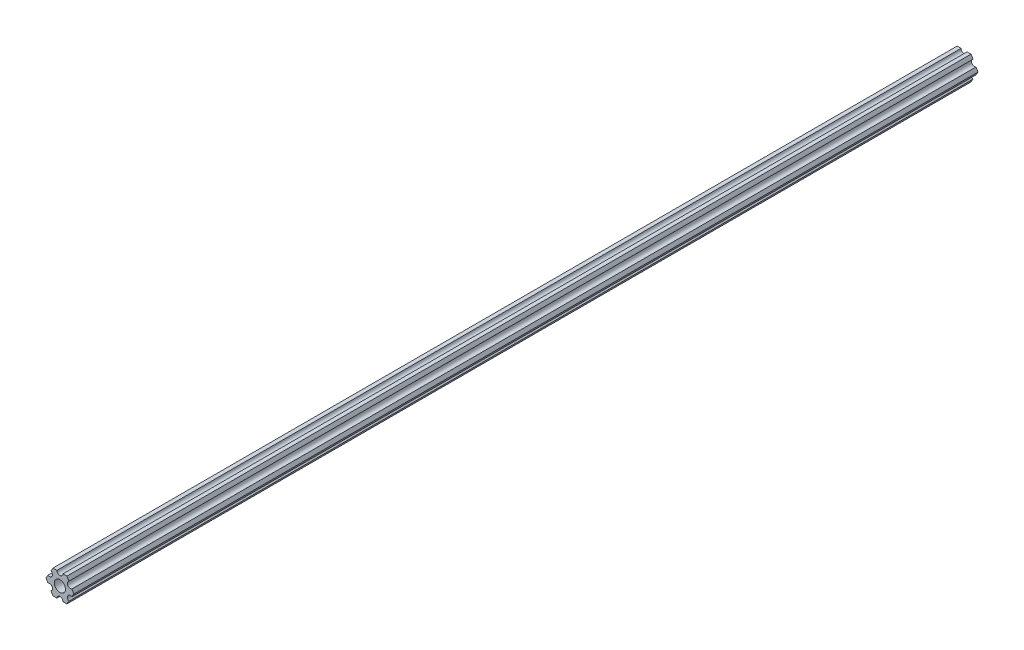
ISO-10303-21;
HEADER;
FILE_DESCRIPTION(('STEP AP214'),'2;1');
FILE_NAME('part.step','',(''),(''),'','','');
FILE_SCHEMA(('AUTOMOTIVE_DESIGN { 1 0 10303 214 1 1 1 1 }'));
ENDSEC;
DATA;
#1=APPLICATION_CONTEXT('core data for automotive mechanical design processes');
#2=APPLICATION_PROTOCOL_DEFINITION('international standard','automotive_design',2000,#1);
#3=PRODUCT_CONTEXT('',#1,'mechanical');
#4=PRODUCT('Part','Part','',(#3));
#5=PRODUCT_RELATED_PRODUCT_CATEGORY('part','',(#4));
#6=PRODUCT_DEFINITION_FORMATION('','',#4);
#7=PRODUCT_DEFINITION_CONTEXT('part definition',#1,'design');
#8=PRODUCT_DEFINITION('design','',#6,#7);
#9=PRODUCT_DEFINITION_SHAPE('','',#8);
#10=(LENGTH_UNIT() NAMED_UNIT(*) SI_UNIT(.MILLI.,.METRE.));
#11=(NAMED_UNIT(*) PLANE_ANGLE_UNIT() SI_UNIT($,.RADIAN.));
#12=(NAMED_UNIT(*) SI_UNIT($,.STERADIAN.) SOLID_ANGLE_UNIT());
#13=UNCERTAINTY_MEASURE_WITH_UNIT(LENGTH_MEASURE(1.E-05),#10,'distance_accuracy_value','');
#14=(GEOMETRIC_REPRESENTATION_CONTEXT(3) GLOBAL_UNCERTAINTY_ASSIGNED_CONTEXT((#13)) GLOBAL_UNIT_ASSIGNED_CONTEXT((#10,
#11,#12)) REPRESENTATION_CONTEXT('',''));
#15=CARTESIAN_POINT('',(0.,0.,0.));
#16=DIRECTION('',(0.,0.,1.));
#17=DIRECTION('',(1.,0.,0.));
#18=AXIS2_PLACEMENT_3D('',#15,#16,#17);
#19=CARTESIAN_POINT('',(5.49926150638083,-3.17499966684068,476.25));
#20=DIRECTION('',(0.,0.,-1.));
#21=DIRECTION('',(-1.,0.,0.));
#22=AXIS2_PLACEMENT_3D('',#19,#20,#21);
#23=CYLINDRICAL_SURFACE('',#22,1.58750000000001);
#24=CARTESIAN_POINT('',(5.49926150638083,-3.17499966684068,0.));
#25=DIRECTION('',(0.,0.,1.));
#26=DIRECTION('',(1.,0.,0.));
#27=AXIS2_PLACEMENT_3D('',#24,#25,#26);
#28=CIRCLE('',#27,1.58750000000001);
#29=CARTESIAN_POINT('',(6.29301142309098,-1.80018429024546,0.));
#30=VERTEX_POINT('',#29);
#31=CARTESIAN_POINT('',(4.70551158967068,-4.54981504343589,0.));
#32=VERTEX_POINT('',#31);
#33=EDGE_CURVE('E190',#30,#32,#28,.T.);
#34=ORIENTED_EDGE('',*,*,#33,.F.);
#35=DIRECTION('',(0.,0.,-1.));
#36=VECTOR('',#35,1.);
#37=CARTESIAN_POINT('',(6.29301142309098,-1.80018429024546,476.25));
#38=LINE('',#37,#36);
#39=CARTESIAN_POINT('',(6.29301142309098,-1.80018429024546,476.25));
#40=VERTEX_POINT('',#39);
#41=EDGE_CURVE('E11',#40,#30,#38,.T.);
#42=ORIENTED_EDGE('',*,*,#41,.F.);
#43=CARTESIAN_POINT('',(5.49926150638083,-3.17499966684068,476.25));
#44=DIRECTION('',(0.,0.,1.));
#45=DIRECTION('',(1.,0.,0.));
#46=AXIS2_PLACEMENT_3D('',#43,#44,#45);
#47=CIRCLE('',#46,1.58750000000001);
#48=CARTESIAN_POINT('',(4.70551158967068,-4.54981504343589,476.25));
#49=VERTEX_POINT('',#48);
#50=EDGE_CURVE('E241',#40,#49,#47,.T.);
#51=ORIENTED_EDGE('',*,*,#50,.T.);
#52=DIRECTION('',(0.,0.,-1.));
#53=VECTOR('',#52,1.);
#54=CARTESIAN_POINT('',(4.70551158967068,-4.54981504343589,476.25));
#55=LINE('',#54,#53);
#56=EDGE_CURVE('E36',#49,#32,#55,.T.);
#57=ORIENTED_EDGE('',*,*,#56,.T.);
#58=EDGE_LOOP('',(#34,#42,#51,#57));
#59=FACE_BOUND('',#58,.T.);
#60=ADVANCED_FACE('F33',(#59),#23,.F.);
#61=CARTESIAN_POINT('',(7.33234841870826,4.44212518856872E-07,476.25));
#62=DIRECTION('',(0.866025434075723,-0.499999947533953,0.));
#63=DIRECTION('',(0.499999947533953,0.866025434075723,0.));
#64=AXIS2_PLACEMENT_3D('',#61,#62,#63);
#65=PLANE('',#64);
#66=DIRECTION('',(-0.499999947533953,-0.866025434075723,0.));
#67=VECTOR('',#66,1.);
#68=CARTESIAN_POINT('',(7.33234841870826,4.44212518856872E-07,0.));
#69=LINE('',#68,#67);
#70=CARTESIAN_POINT('',(7.33234841870826,4.44212518856872E-07,0.));
#71=VERTEX_POINT('',#70);
#72=EDGE_CURVE('E239',#71,#30,#69,.T.);
#73=ORIENTED_EDGE('',*,*,#72,.F.);
#74=DIRECTION('',(0.,0.,-1.));
#75=VECTOR('',#74,1.);
#76=CARTESIAN_POINT('',(7.33234841870826,4.44212518856872E-07,476.25));
#77=LINE('',#76,#75);
#78=CARTESIAN_POINT('',(7.33234841870826,4.44212518856872E-07,476.25));
#79=VERTEX_POINT('',#78);
#80=EDGE_CURVE('E42',#79,#71,#77,.T.);
#81=ORIENTED_EDGE('',*,*,#80,.F.);
#82=DIRECTION('',(-0.499999947533953,-0.866025434075723,0.));
#83=VECTOR('',#82,1.);
#84=CARTESIAN_POINT('',(7.33234841870826,4.44212518856872E-07,476.25));
#85=LINE('',#84,#83);
#86=EDGE_CURVE('E180',#79,#40,#85,.T.);
#87=ORIENTED_EDGE('',*,*,#86,.T.);
#88=ORIENTED_EDGE('',*,*,#41,.T.);
#89=EDGE_LOOP('',(#73,#81,#87,#88));
#90=FACE_BOUND('',#89,.T.);
#91=ADVANCED_FACE('F273',(#90),#65,.T.);
#92=CARTESIAN_POINT('',(6.29301120497139,1.80018505273895,476.25));
#93=DIRECTION('',(0.866025373493145,0.500000052466056,0.));
#94=DIRECTION('',(-0.500000052466056,0.866025373493145,0.));
#95=AXIS2_PLACEMENT_3D('',#92,#93,#94);
#96=PLANE('',#95);
#97=DIRECTION('',(0.500000052466056,-0.866025373493145,0.));
#98=VECTOR('',#97,1.);
#99=CARTESIAN_POINT('',(6.29301120497139,1.80018505273895,0.));
#100=LINE('',#99,#98);
#101=CARTESIAN_POINT('',(6.29301120497139,1.80018505273895,0.));
#102=VERTEX_POINT('',#101);
#103=EDGE_CURVE('E167',#102,#71,#100,.T.);
#104=ORIENTED_EDGE('',*,*,#103,.F.);
#105=DIRECTION('',(0.,0.,-1.));
#106=VECTOR('',#105,1.);
#107=CARTESIAN_POINT('',(6.29301120497139,1.80018505273895,476.25));
#108=LINE('',#107,#106);
#109=CARTESIAN_POINT('',(6.29301120497139,1.80018505273895,476.25));
#110=VERTEX_POINT('',#109);
#111=EDGE_CURVE('E162',#110,#102,#108,.T.);
#112=ORIENTED_EDGE('',*,*,#111,.F.);
#113=DIRECTION('',(0.500000052466056,-0.866025373493145,0.));
#114=VECTOR('',#113,1.);
#115=CARTESIAN_POINT('',(6.29301120497139,1.80018505273895,476.25));
#116=LINE('',#115,#114);
#117=EDGE_CURVE('E165',#110,#79,#116,.T.);
#118=ORIENTED_EDGE('',*,*,#117,.T.);
#119=ORIENTED_EDGE('',*,*,#80,.T.);
#120=EDGE_LOOP('',(#104,#112,#118,#119));
#121=FACE_BOUND('',#120,.T.);
#122=ADVANCED_FACE('F164',(#121),#96,.T.);
#123=CARTESIAN_POINT('',(5.49926112168152,3.17500033315931,476.25));
#124=DIRECTION('',(0.,0.,-1.));
#125=DIRECTION('',(-1.,0.,0.));
#126=AXIS2_PLACEMENT_3D('',#123,#124,#125);
#127=CYLINDRICAL_SURFACE('',#126,1.5875);
#128=CARTESIAN_POINT('',(5.49926112168152,3.17500033315931,0.));
#129=DIRECTION('',(0.,0.,1.));
#130=DIRECTION('',(1.,0.,0.));
#131=AXIS2_PLACEMENT_3D('',#128,#129,#130);
#132=CIRCLE('',#131,1.5875);
#133=CARTESIAN_POINT('',(4.70551103839166,4.54981561357968,0.));
#134=VERTEX_POINT('',#133);
#135=EDGE_CURVE('E236',#134,#102,#132,.T.);
#136=ORIENTED_EDGE('',*,*,#135,.F.);
#137=DIRECTION('',(0.,0.,-1.));
#138=VECTOR('',#137,1.);
#139=CARTESIAN_POINT('',(4.70551103839166,4.54981561357968,476.25));
#140=LINE('',#139,#138);
#141=CARTESIAN_POINT('',(4.70551103839166,4.54981561357968,476.25));
#142=VERTEX_POINT('',#141);
#143=EDGE_CURVE('E172',#142,#134,#140,.T.);
#144=ORIENTED_EDGE('',*,*,#143,.F.);
#145=CARTESIAN_POINT('',(5.49926112168152,3.17500033315931,476.25));
#146=DIRECTION('',(0.,0.,1.));
#147=DIRECTION('',(1.,0.,0.));
#148=AXIS2_PLACEMENT_3D('',#145,#146,#147);
#149=CIRCLE('',#148,1.5875);
#150=EDGE_CURVE('E178',#142,#110,#149,.T.);
#151=ORIENTED_EDGE('',*,*,#150,.T.);
#152=ORIENTED_EDGE('',*,*,#111,.T.);
#153=EDGE_LOOP('',(#136,#144,#151,#152));
#154=FACE_BOUND('',#153,.T.);
#155=ADVANCED_FACE('F182',(#154),#127,.F.);
#156=CARTESIAN_POINT('',(3.66617382465472,6.35000022210622,476.25));
#157=DIRECTION('',(0.866025373493145,0.500000052466056,0.));
#158=DIRECTION('',(-0.500000052466056,0.866025373493145,0.));
#159=AXIS2_PLACEMENT_3D('',#156,#157,#158);
#160=PLANE('',#159);
#161=DIRECTION('',(0.500000052466056,-0.866025373493145,0.));
#162=VECTOR('',#161,1.);
#163=CARTESIAN_POINT('',(3.66617382465472,6.35000022210622,0.));
#164=LINE('',#163,#162);
#165=CARTESIAN_POINT('',(3.66617382465472,6.35000022210622,0.));
#166=VERTEX_POINT('',#165);
#167=EDGE_CURVE('E233',#166,#134,#164,.T.);
#168=ORIENTED_EDGE('',*,*,#167,.F.);
#169=DIRECTION('',(0.,0.,-1.));
#170=VECTOR('',#169,1.);
#171=CARTESIAN_POINT('',(3.66617382465472,6.35000022210622,476.25));
#172=LINE('',#171,#170);
#173=CARTESIAN_POINT('',(3.66617382465472,6.35000022210622,476.25));
#174=VERTEX_POINT('',#173);
#175=EDGE_CURVE('E245',#174,#166,#172,.T.);
#176=ORIENTED_EDGE('',*,*,#175,.F.);
#177=DIRECTION('',(0.500000052466056,-0.866025373493145,0.));
#178=VECTOR('',#177,1.);
#179=CARTESIAN_POINT('',(3.66617382465472,6.35000022210622,476.25));
#180=LINE('',#179,#178);
#181=EDGE_CURVE('E183',#174,#142,#180,.T.);
#182=ORIENTED_EDGE('',*,*,#181,.T.);
#183=ORIENTED_EDGE('',*,*,#143,.T.);
#184=EDGE_LOOP('',(#168,#176,#182,#183));
#185=FACE_BOUND('',#184,.T.);
#186=ADVANCED_FACE('F286',(#185),#160,.T.);
#187=CARTESIAN_POINT('',(1.58749961530066,6.35000022210623,476.25));
#188=DIRECTION('',(0.,1.,0.));
#189=DIRECTION('',(-1.,0.,0.));
#190=AXIS2_PLACEMENT_3D('',#187,#188,#189);
#191=PLANE('',#190);
#192=DIRECTION('',(1.,0.,0.));
#193=VECTOR('',#192,1.);
#194=CARTESIAN_POINT('',(1.58749961530066,6.35000022210623,0.));
#195=LINE('',#194,#193);
#196=CARTESIAN_POINT('',(1.58749961530066,6.35000022210623,0.));
#197=VERTEX_POINT('',#196);
#198=EDGE_CURVE('E230',#197,#166,#195,.T.);
#199=ORIENTED_EDGE('',*,*,#198,.F.);
#200=DIRECTION('',(0.,0.,-1.));
#201=VECTOR('',#200,1.);
#202=CARTESIAN_POINT('',(1.58749961530066,6.35000022210623,476.25));
#203=LINE('',#202,#201);
#204=CARTESIAN_POINT('',(1.58749961530066,6.35000022210623,476.25));
#205=VERTEX_POINT('',#204);
#206=EDGE_CURVE('E247',#205,#197,#203,.T.);
#207=ORIENTED_EDGE('',*,*,#206,.F.);
#208=DIRECTION('',(1.,0.,0.));
#209=VECTOR('',#208,1.);
#210=CARTESIAN_POINT('',(1.58749961530066,6.35000022210623,476.25));
#211=LINE('',#210,#209);
#212=EDGE_CURVE('E185',#205,#174,#211,.T.);
#213=ORIENTED_EDGE('',*,*,#212,.T.);
#214=ORIENTED_EDGE('',*,*,#175,.T.);
#215=EDGE_LOOP('',(#199,#207,#213,#214));
#216=FACE_BOUND('',#215,.T.);
#217=ADVANCED_FACE('F289',(#216),#191,.T.);
#218=CARTESIAN_POINT('',(-3.84699344941095E-07,6.35000022210623,476.25));
#219=DIRECTION('',(0.,0.,-1.));
#220=DIRECTION('',(-1.,0.,0.));
#221=AXIS2_PLACEMENT_3D('',#218,#219,#220);
#222=CYLINDRICAL_SURFACE('',#221,1.5875);
#223=CARTESIAN_POINT('',(-3.84699344941095E-07,6.35000022210623,0.));
#224=DIRECTION('',(0.,0.,1.));
#225=DIRECTION('',(1.,0.,0.));
#226=AXIS2_PLACEMENT_3D('',#223,#224,#225);
#227=CIRCLE('',#226,1.5875);
#228=CARTESIAN_POINT('',(-1.58750038469935,6.35000022210623,0.));
#229=VERTEX_POINT('',#228);
#230=EDGE_CURVE('E227',#229,#197,#227,.T.);
#231=ORIENTED_EDGE('',*,*,#230,.F.);
#232=DIRECTION('',(0.,0.,-1.));
#233=VECTOR('',#232,1.);
#234=CARTESIAN_POINT('',(-1.58750038469935,6.35000022210623,476.25));
#235=LINE('',#234,#233);
#236=CARTESIAN_POINT('',(-1.58750038469935,6.35000022210623,476.25));
#237=VERTEX_POINT('',#236);
#238=EDGE_CURVE('E249',#237,#229,#235,.T.);
#239=ORIENTED_EDGE('',*,*,#238,.F.);
#240=CARTESIAN_POINT('',(-3.84699344941095E-07,6.35000022210623,476.25));
#241=DIRECTION('',(0.,0.,1.));
#242=DIRECTION('',(1.,0.,0.));
#243=AXIS2_PLACEMENT_3D('',#240,#241,#242);
#244=CIRCLE('',#243,1.5875);
#245=EDGE_CURVE('E394',#237,#205,#244,.T.);
#246=ORIENTED_EDGE('',*,*,#245,.T.);
#247=ORIENTED_EDGE('',*,*,#206,.T.);
#248=EDGE_LOOP('',(#231,#239,#246,#247));
#249=FACE_BOUND('',#248,.T.);
#250=ADVANCED_FACE('F293',(#249),#222,.F.);
#251=CARTESIAN_POINT('',(-3.66617452134701,6.35000022210623,476.25));
#252=DIRECTION('',(0.,1.,0.));
#253=DIRECTION('',(0.,0.,1.));
#254=AXIS2_PLACEMENT_3D('',#251,#252,#253);
#255=PLANE('',#254);
#256=DIRECTION('',(1.,0.,0.));
#257=VECTOR('',#256,1.);
#258=CARTESIAN_POINT('',(-3.66617452134701,6.35000022210623,0.));
#259=LINE('',#258,#257);
#260=CARTESIAN_POINT('',(-3.66617452134701,6.35000022210623,0.));
#261=VERTEX_POINT('',#260);
#262=EDGE_CURVE('E224',#261,#229,#259,.T.);
#263=ORIENTED_EDGE('',*,*,#262,.F.);
#264=DIRECTION('',(0.,0.,-1.));
#265=VECTOR('',#264,1.);
#266=CARTESIAN_POINT('',(-3.66617452134701,6.35000022210623,476.25));
#267=LINE('',#266,#265);
#268=CARTESIAN_POINT('',(-3.66617452134701,6.35000022210623,476.25));
#269=VERTEX_POINT('',#268);
#270=EDGE_CURVE('E251',#269,#261,#267,.T.);
#271=ORIENTED_EDGE('',*,*,#270,.F.);
#272=DIRECTION('',(1.,0.,0.));
#273=VECTOR('',#272,1.);
#274=CARTESIAN_POINT('',(-3.66617452134701,6.35000022210623,476.25));
#275=LINE('',#274,#273);
#276=EDGE_CURVE('E391',#269,#237,#275,.T.);
#277=ORIENTED_EDGE('',*,*,#276,.T.);
#278=ORIENTED_EDGE('',*,*,#238,.T.);
#279=EDGE_LOOP('',(#263,#271,#277,#278));
#280=FACE_BOUND('',#279,.T.);
#281=ADVANCED_FACE('F297',(#280),#255,.T.);
#282=CARTESIAN_POINT('',(-4.70551145677116,4.54981548085265,476.25));
#283=DIRECTION('',(-0.866025447431971,0.499999924400249,0.));
#284=DIRECTION('',(-0.499999924400249,-0.866025447431971,0.));
#285=AXIS2_PLACEMENT_3D('',#282,#283,#284);
#286=PLANE('',#285);
#287=DIRECTION('',(0.499999924400249,0.866025447431971,0.));
#288=VECTOR('',#287,1.);
#289=CARTESIAN_POINT('',(-4.70551145677116,4.54981548085265,0.));
#290=LINE('',#289,#288);
#291=CARTESIAN_POINT('',(-4.70551145677116,4.54981548085265,0.));
#292=VERTEX_POINT('',#291);
#293=EDGE_CURVE('E221',#292,#261,#290,.T.);
#294=ORIENTED_EDGE('',*,*,#293,.F.);
#295=DIRECTION('',(0.,0.,-1.));
#296=VECTOR('',#295,1.);
#297=CARTESIAN_POINT('',(-4.70551145677116,4.54981548085265,476.25));
#298=LINE('',#297,#296);
#299=CARTESIAN_POINT('',(-4.70551145677116,4.54981548085265,476.25));
#300=VERTEX_POINT('',#299);
#301=EDGE_CURVE('E253',#300,#292,#298,.T.);
#302=ORIENTED_EDGE('',*,*,#301,.F.);
#303=DIRECTION('',(0.499999924400249,0.866025447431971,0.));
#304=VECTOR('',#303,1.);
#305=CARTESIAN_POINT('',(-4.70551145677116,4.54981548085265,476.25));
#306=LINE('',#305,#304);
#307=EDGE_CURVE('E388',#300,#269,#306,.T.);
#308=ORIENTED_EDGE('',*,*,#307,.T.);
#309=ORIENTED_EDGE('',*,*,#270,.T.);
#310=EDGE_LOOP('',(#294,#302,#308,#309));
#311=FACE_BOUND('',#310,.T.);
#312=ADVANCED_FACE('F301',(#311),#286,.T.);
#313=CARTESIAN_POINT('',(-5.49926133675655,3.17500008305439,476.25));
#314=DIRECTION('',(0.,0.,-1.));
#315=DIRECTION('',(-1.,0.,0.));
#316=AXIS2_PLACEMENT_3D('',#313,#314,#315);
#317=CYLINDRICAL_SURFACE('',#316,1.5875);
#318=CARTESIAN_POINT('',(-5.49926133675655,3.17500008305439,0.));
#319=DIRECTION('',(0.,0.,1.));
#320=DIRECTION('',(1.,0.,0.));
#321=AXIS2_PLACEMENT_3D('',#318,#319,#320);
#322=CIRCLE('',#321,1.5875);
#323=CARTESIAN_POINT('',(-6.29301121674195,1.80018468525613,0.));
#324=VERTEX_POINT('',#323);
#325=EDGE_CURVE('E218',#324,#292,#322,.T.);
#326=ORIENTED_EDGE('',*,*,#325,.F.);
#327=DIRECTION('',(0.,0.,-1.));
#328=VECTOR('',#327,1.);
#329=CARTESIAN_POINT('',(-6.29301121674195,1.80018468525613,476.25));
#330=LINE('',#329,#328);
#331=CARTESIAN_POINT('',(-6.29301121674195,1.80018468525613,476.25));
#332=VERTEX_POINT('',#331);
#333=EDGE_CURVE('E255',#332,#324,#330,.T.);
#334=ORIENTED_EDGE('',*,*,#333,.F.);
#335=CARTESIAN_POINT('',(-5.49926133675655,3.17500008305439,476.25));
#336=DIRECTION('',(0.,0.,1.));
#337=DIRECTION('',(1.,0.,0.));
#338=AXIS2_PLACEMENT_3D('',#335,#336,#337);
#339=CIRCLE('',#338,1.5875);
#340=EDGE_CURVE('E385',#332,#300,#339,.T.);
#341=ORIENTED_EDGE('',*,*,#340,.T.);
#342=ORIENTED_EDGE('',*,*,#301,.T.);
#343=EDGE_LOOP('',(#326,#334,#341,#342));
#344=FACE_BOUND('',#343,.T.);
#345=ADVANCED_FACE('F305',(#344),#317,.F.);
#346=CARTESIAN_POINT('',(-7.33234807945963,6.99338729030344E-08,476.25));
#347=DIRECTION('',(-0.866025447431971,0.499999924400249,0.));
#348=DIRECTION('',(-0.499999924400249,-0.866025447431971,0.));
#349=AXIS2_PLACEMENT_3D('',#346,#347,#348);
#350=PLANE('',#349);
#351=DIRECTION('',(0.499999924400249,0.866025447431971,0.));
#352=VECTOR('',#351,1.);
#353=CARTESIAN_POINT('',(-7.33234807945963,6.99338729030344E-08,0.));
#354=LINE('',#353,#352);
#355=CARTESIAN_POINT('',(-7.33234807945963,6.99338729030344E-08,0.));
#356=VERTEX_POINT('',#355);
#357=EDGE_CURVE('E215',#356,#324,#354,.T.);
#358=ORIENTED_EDGE('',*,*,#357,.F.);
#359=DIRECTION('',(0.,0.,-1.));
#360=VECTOR('',#359,1.);
#361=CARTESIAN_POINT('',(-7.33234807945963,6.99338729030344E-08,476.25));
#362=LINE('',#361,#360);
#363=CARTESIAN_POINT('',(-7.33234807945963,6.99338729030344E-08,476.25));
#364=VERTEX_POINT('',#363);
#365=EDGE_CURVE('E257',#364,#356,#362,.T.);
#366=ORIENTED_EDGE('',*,*,#365,.F.);
#367=DIRECTION('',(0.499999924400249,0.866025447431971,0.));
#368=VECTOR('',#367,1.);
#369=CARTESIAN_POINT('',(-7.33234807945963,6.99338729030344E-08,476.25));
#370=LINE('',#369,#368);
#371=EDGE_CURVE('E382',#364,#332,#370,.T.);
#372=ORIENTED_EDGE('',*,*,#371,.T.);
#373=ORIENTED_EDGE('',*,*,#333,.T.);
#374=EDGE_LOOP('',(#358,#366,#372,#373));
#375=FACE_BOUND('',#374,.T.);
#376=ADVANCED_FACE('F309',(#375),#350,.T.);
#377=CARTESIAN_POINT('',(-6.29301096189761,-1.80018459411914,476.25));
#378=DIRECTION('',(-0.866025400205645,-0.500000006198653,0.));
#379=DIRECTION('',(0.500000006198653,-0.866025400205645,0.));
#380=AXIS2_PLACEMENT_3D('',#377,#378,#379);
#381=PLANE('',#380);
#382=DIRECTION('',(-0.500000006198653,0.866025400205645,0.));
#383=VECTOR('',#382,1.);
#384=CARTESIAN_POINT('',(-6.29301096189761,-1.80018459411914,0.));
#385=LINE('',#384,#383);
#386=CARTESIAN_POINT('',(-6.29301096189761,-1.80018459411914,0.));
#387=VERTEX_POINT('',#386);
#388=EDGE_CURVE('E212',#387,#356,#385,.T.);
#389=ORIENTED_EDGE('',*,*,#388,.F.);
#390=DIRECTION('',(0.,0.,-1.));
#391=VECTOR('',#390,1.);
#392=CARTESIAN_POINT('',(-6.29301096189761,-1.80018459411914,476.25));
#393=LINE('',#392,#391);
#394=CARTESIAN_POINT('',(-6.29301096189761,-1.80018459411914,476.25));
#395=VERTEX_POINT('',#394);
#396=EDGE_CURVE('E259',#395,#387,#393,.T.);
#397=ORIENTED_EDGE('',*,*,#396,.F.);
#398=DIRECTION('',(-0.500000006198653,0.866025400205645,0.));
#399=VECTOR('',#398,1.);
#400=CARTESIAN_POINT('',(-6.29301096189761,-1.80018459411914,476.25));
#401=LINE('',#400,#399);
#402=EDGE_CURVE('E379',#395,#364,#401,.T.);
#403=ORIENTED_EDGE('',*,*,#402,.T.);
#404=ORIENTED_EDGE('',*,*,#365,.T.);
#405=EDGE_LOOP('',(#389,#397,#403,#404));
#406=FACE_BOUND('',#405,.T.);
#407=ADVANCED_FACE('F313',(#406),#381,.T.);
#408=CARTESIAN_POINT('',(-5.49926095205725,-3.1749999169456,476.25));
#409=DIRECTION('',(0.,0.,-1.));
#410=DIRECTION('',(-1.,0.,0.));
#411=AXIS2_PLACEMENT_3D('',#408,#409,#410);
#412=CYLINDRICAL_SURFACE('',#411,1.5875);
#413=CARTESIAN_POINT('',(-5.49926095205725,-3.1749999169456,0.));
#414=DIRECTION('',(0.,0.,1.));
#415=DIRECTION('',(1.,0.,0.));
#416=AXIS2_PLACEMENT_3D('',#413,#414,#415);
#417=CIRCLE('',#416,1.5875);
#418=CARTESIAN_POINT('',(-4.70551094221689,-4.54981523977206,0.));
#419=VERTEX_POINT('',#418);
#420=EDGE_CURVE('E209',#419,#387,#417,.T.);
#421=ORIENTED_EDGE('',*,*,#420,.F.);
#422=DIRECTION('',(0.,0.,-1.));
#423=VECTOR('',#422,1.);
#424=CARTESIAN_POINT('',(-4.70551094221689,-4.54981523977206,476.25));
#425=LINE('',#424,#423);
#426=CARTESIAN_POINT('',(-4.70551094221689,-4.54981523977206,476.25));
#427=VERTEX_POINT('',#426);
#428=EDGE_CURVE('E261',#427,#419,#425,.T.);
#429=ORIENTED_EDGE('',*,*,#428,.F.);
#430=CARTESIAN_POINT('',(-5.49926095205725,-3.1749999169456,476.25));
#431=DIRECTION('',(0.,0.,1.));
#432=DIRECTION('',(1.,0.,0.));
#433=AXIS2_PLACEMENT_3D('',#430,#431,#432);
#434=CIRCLE('',#433,1.5875);
#435=EDGE_CURVE('E376',#427,#395,#434,.T.);
#436=ORIENTED_EDGE('',*,*,#435,.T.);
#437=ORIENTED_EDGE('',*,*,#396,.T.);
#438=EDGE_LOOP('',(#421,#429,#436,#437));
#439=FACE_BOUND('',#438,.T.);
#440=ADVANCED_FACE('F317',(#439),#412,.F.);
#441=CARTESIAN_POINT('',(-3.66617382465481,-6.34999990382519,476.25));
#442=DIRECTION('',(-0.866025400205645,-0.500000006198653,0.));
#443=DIRECTION('',(0.500000006198653,-0.866025400205645,0.));
#444=AXIS2_PLACEMENT_3D('',#441,#442,#443);
#445=PLANE('',#444);
#446=DIRECTION('',(-0.500000006198653,0.866025400205644,0.));
#447=VECTOR('',#446,1.);
#448=CARTESIAN_POINT('',(-3.66617382465481,-6.34999990382519,0.));
#449=LINE('',#448,#447);
#450=CARTESIAN_POINT('',(-3.66617382465481,-6.34999990382519,0.));
#451=VERTEX_POINT('',#450);
#452=EDGE_CURVE('E206',#451,#419,#449,.T.);
#453=ORIENTED_EDGE('',*,*,#452,.F.);
#454=DIRECTION('',(0.,0.,-1.));
#455=VECTOR('',#454,1.);
#456=CARTESIAN_POINT('',(-3.66617382465481,-6.34999990382519,476.25));
#457=LINE('',#456,#455);
#458=CARTESIAN_POINT('',(-3.66617382465481,-6.34999990382519,476.25));
#459=VERTEX_POINT('',#458);
#460=EDGE_CURVE('E263',#459,#451,#457,.T.);
#461=ORIENTED_EDGE('',*,*,#460,.F.);
#462=DIRECTION('',(-0.500000006198653,0.866025400205644,0.));
#463=VECTOR('',#462,1.);
#464=CARTESIAN_POINT('',(-3.66617382465481,-6.34999990382519,476.25));
#465=LINE('',#464,#463);
#466=EDGE_CURVE('E373',#459,#427,#465,.T.);
#467=ORIENTED_EDGE('',*,*,#466,.T.);
#468=ORIENTED_EDGE('',*,*,#428,.T.);
#469=EDGE_LOOP('',(#453,#461,#467,#468));
#470=FACE_BOUND('',#469,.T.);
#471=ADVANCED_FACE('F321',(#470),#445,.T.);
#472=CARTESIAN_POINT('',(-1.58749961530074,-6.34999990382519,476.25));
#473=DIRECTION('',(0.,-1.,0.));
#474=DIRECTION('',(1.,0.,0.));
#475=AXIS2_PLACEMENT_3D('',#472,#473,#474);
#476=PLANE('',#475);
#477=DIRECTION('',(-1.,0.,0.));
#478=VECTOR('',#477,1.);
#479=CARTESIAN_POINT('',(-1.58749961530074,-6.34999990382519,0.));
#480=LINE('',#479,#478);
#481=CARTESIAN_POINT('',(-1.58749961530074,-6.34999990382519,0.));
#482=VERTEX_POINT('',#481);
#483=EDGE_CURVE('E203',#482,#451,#480,.T.);
#484=ORIENTED_EDGE('',*,*,#483,.F.);
#485=DIRECTION('',(0.,0.,-1.));
#486=VECTOR('',#485,1.);
#487=CARTESIAN_POINT('',(-1.58749961530074,-6.34999990382519,476.25));
#488=LINE('',#487,#486);
#489=CARTESIAN_POINT('',(-1.58749961530074,-6.34999990382519,476.25));
#490=VERTEX_POINT('',#489);
#491=EDGE_CURVE('E265',#490,#482,#488,.T.);
#492=ORIENTED_EDGE('',*,*,#491,.F.);
#493=DIRECTION('',(-1.,0.,0.));
#494=VECTOR('',#493,1.);
#495=CARTESIAN_POINT('',(-1.58749961530074,-6.34999990382519,476.25));
#496=LINE('',#495,#494);
#497=EDGE_CURVE('E370',#490,#459,#496,.T.);
#498=ORIENTED_EDGE('',*,*,#497,.T.);
#499=ORIENTED_EDGE('',*,*,#460,.T.);
#500=EDGE_LOOP('',(#484,#492,#498,#499));
#501=FACE_BOUND('',#500,.T.);
#502=ADVANCED_FACE('F325',(#501),#476,.T.);
#503=CARTESIAN_POINT('',(3.8469926204343E-07,-6.34999990382519,476.25));
#504=DIRECTION('',(0.,0.,-1.));
#505=DIRECTION('',(-1.,0.,0.));
#506=AXIS2_PLACEMENT_3D('',#503,#504,#505);
#507=CYLINDRICAL_SURFACE('',#506,1.5875);
#508=CARTESIAN_POINT('',(3.8469926204343E-07,-6.34999990382519,0.));
#509=DIRECTION('',(0.,0.,1.));
#510=DIRECTION('',(1.,0.,0.));
#511=AXIS2_PLACEMENT_3D('',#508,#509,#510);
#512=CIRCLE('',#511,1.5875);
#513=CARTESIAN_POINT('',(1.58750038469926,-6.34999990382518,0.));
#514=VERTEX_POINT('',#513);
#515=EDGE_CURVE('E200',#514,#482,#512,.T.);
#516=ORIENTED_EDGE('',*,*,#515,.F.);
#517=DIRECTION('',(0.,0.,-1.));
#518=VECTOR('',#517,1.);
#519=CARTESIAN_POINT('',(1.58750038469926,-6.34999990382518,476.25));
#520=LINE('',#519,#518);
#521=CARTESIAN_POINT('',(1.58750038469926,-6.34999990382518,476.25));
#522=VERTEX_POINT('',#521);
#523=EDGE_CURVE('E267',#522,#514,#520,.T.);
#524=ORIENTED_EDGE('',*,*,#523,.F.);
#525=CARTESIAN_POINT('',(3.8469926204343E-07,-6.34999990382519,476.25));
#526=DIRECTION('',(0.,0.,1.));
#527=DIRECTION('',(1.,0.,0.));
#528=AXIS2_PLACEMENT_3D('',#525,#526,#527);
#529=CIRCLE('',#528,1.5875);
#530=EDGE_CURVE('E367',#522,#490,#529,.T.);
#531=ORIENTED_EDGE('',*,*,#530,.T.);
#532=ORIENTED_EDGE('',*,*,#491,.T.);
#533=EDGE_LOOP('',(#516,#524,#531,#532));
#534=FACE_BOUND('',#533,.T.);
#535=ADVANCED_FACE('F329',(#534),#507,.F.);
#536=CARTESIAN_POINT('',(3.66617452134693,-6.34999990382519,476.25));
#537=DIRECTION('',(0.,-1.,0.));
#538=DIRECTION('',(1.,0.,0.));
#539=AXIS2_PLACEMENT_3D('',#536,#537,#538);
#540=PLANE('',#539);
#541=DIRECTION('',(-1.,0.,0.));
#542=VECTOR('',#541,1.);
#543=CARTESIAN_POINT('',(3.66617452134693,-6.34999990382519,0.));
#544=LINE('',#543,#542);
#545=CARTESIAN_POINT('',(3.66617452134693,-6.34999990382519,0.));
#546=VERTEX_POINT('',#545);
#547=EDGE_CURVE('E197',#546,#514,#544,.T.);
#548=ORIENTED_EDGE('',*,*,#547,.F.);
#549=DIRECTION('',(0.,0.,-1.));
#550=VECTOR('',#549,1.);
#551=CARTESIAN_POINT('',(3.66617452134693,-6.34999990382519,476.25));
#552=LINE('',#551,#550);
#553=CARTESIAN_POINT('',(3.66617452134693,-6.34999990382519,476.25));
#554=VERTEX_POINT('',#553);
#555=EDGE_CURVE('E268',#554,#546,#552,.T.);
#556=ORIENTED_EDGE('',*,*,#555,.F.);
#557=DIRECTION('',(-1.,0.,0.));
#558=VECTOR('',#557,1.);
#559=CARTESIAN_POINT('',(3.66617452134693,-6.34999990382519,476.25));
#560=LINE('',#559,#558);
#561=EDGE_CURVE('E364',#554,#522,#560,.T.);
#562=ORIENTED_EDGE('',*,*,#561,.T.);
#563=ORIENTED_EDGE('',*,*,#523,.T.);
#564=EDGE_LOOP('',(#548,#556,#562,#563));
#565=FACE_BOUND('',#564,.T.);
#566=ADVANCED_FACE('F333',(#565),#540,.T.);
#567=CARTESIAN_POINT('',(4.70551158967068,-4.54981504343589,476.25));
#568=DIRECTION('',(0.866025434075723,-0.499999947533953,0.));
#569=DIRECTION('',(0.499999947533953,0.866025434075723,0.));
#570=AXIS2_PLACEMENT_3D('',#567,#568,#569);
#571=PLANE('',#570);
#572=DIRECTION('',(-0.499999947533953,-0.866025434075723,0.));
#573=VECTOR('',#572,1.);
#574=CARTESIAN_POINT('',(4.70551158967068,-4.54981504343589,0.));
#575=LINE('',#574,#573);
#576=EDGE_CURVE('E193',#32,#546,#575,.T.);
#577=ORIENTED_EDGE('',*,*,#576,.F.);
#578=ORIENTED_EDGE('',*,*,#56,.F.);
#579=DIRECTION('',(-0.499999947533953,-0.866025434075723,0.));
#580=VECTOR('',#579,1.);
#581=CARTESIAN_POINT('',(4.70551158967068,-4.54981504343589,476.25));
#582=LINE('',#581,#580);
#583=EDGE_CURVE('E362',#49,#554,#582,.T.);
#584=ORIENTED_EDGE('',*,*,#583,.T.);
#585=ORIENTED_EDGE('',*,*,#555,.T.);
#586=EDGE_LOOP('',(#577,#578,#584,#585));
#587=FACE_BOUND('',#586,.T.);
#588=ADVANCED_FACE('F270',(#587),#571,.T.);
#589=CARTESIAN_POINT('',(5.49926150638083,-3.17499966684068,476.25));
#590=DIRECTION('',(0.,0.,1.));
#591=DIRECTION('',(1.,0.,0.));
#592=AXIS2_PLACEMENT_3D('',#589,#590,#591);
#593=PLANE('',#592);
#594=CARTESIAN_POINT('',(0.,0.,476.25));
#595=DIRECTION('',(0.,0.,-1.));
#596=DIRECTION('',(1.,0.,0.));
#597=AXIS2_PLACEMENT_3D('',#594,#595,#596);
#598=CIRCLE('',#597,2.9337);
#599=CARTESIAN_POINT('',(2.9337,0.,476.25));
#600=VERTEX_POINT('',#599);
#601=EDGE_CURVE('E194',#600,#600,#598,.T.);
#602=ORIENTED_EDGE('',*,*,#601,.T.);
#603=EDGE_LOOP('',(#602));
#604=FACE_BOUND('',#603,.T.);
#605=ORIENTED_EDGE('',*,*,#50,.F.);
#606=ORIENTED_EDGE('',*,*,#86,.F.);
#607=ORIENTED_EDGE('',*,*,#117,.F.);
#608=ORIENTED_EDGE('',*,*,#150,.F.);
#609=ORIENTED_EDGE('',*,*,#181,.F.);
#610=ORIENTED_EDGE('',*,*,#212,.F.);
#611=ORIENTED_EDGE('',*,*,#245,.F.);
#612=ORIENTED_EDGE('',*,*,#276,.F.);
#613=ORIENTED_EDGE('',*,*,#307,.F.);
#614=ORIENTED_EDGE('',*,*,#340,.F.);
#615=ORIENTED_EDGE('',*,*,#371,.F.);
#616=ORIENTED_EDGE('',*,*,#402,.F.);
#617=ORIENTED_EDGE('',*,*,#435,.F.);
#618=ORIENTED_EDGE('',*,*,#466,.F.);
#619=ORIENTED_EDGE('',*,*,#497,.F.);
#620=ORIENTED_EDGE('',*,*,#530,.F.);
#621=ORIENTED_EDGE('',*,*,#561,.F.);
#622=ORIENTED_EDGE('',*,*,#583,.F.);
#623=EDGE_LOOP('',(#605,#606,#607,#608,#609,#610,#611,#612,#613,#614,#615,#616,#617,#618,#619,
#620,#621,#622));
#624=FACE_BOUND('',#623,.T.);
#625=ADVANCED_FACE('F176',(#604,#624),#593,.T.);
#626=CARTESIAN_POINT('',(5.49926150638083,-3.17499966684068,0.));
#627=DIRECTION('',(0.,0.,1.));
#628=DIRECTION('',(1.,0.,0.));
#629=AXIS2_PLACEMENT_3D('',#626,#627,#628);
#630=PLANE('',#629);
#631=CARTESIAN_POINT('',(0.,0.,0.));
#632=DIRECTION('',(0.,0.,-1.));
#633=DIRECTION('',(1.,0.,0.));
#634=AXIS2_PLACEMENT_3D('',#631,#632,#633);
#635=CIRCLE('',#634,2.9337);
#636=CARTESIAN_POINT('',(2.9337,0.,0.));
#637=VERTEX_POINT('',#636);
#638=EDGE_CURVE('E357',#637,#637,#635,.T.);
#639=ORIENTED_EDGE('',*,*,#638,.F.);
#640=EDGE_LOOP('',(#639));
#641=FACE_BOUND('',#640,.T.);
#642=ORIENTED_EDGE('',*,*,#33,.T.);
#643=ORIENTED_EDGE('',*,*,#576,.T.);
#644=ORIENTED_EDGE('',*,*,#547,.T.);
#645=ORIENTED_EDGE('',*,*,#515,.T.);
#646=ORIENTED_EDGE('',*,*,#483,.T.);
#647=ORIENTED_EDGE('',*,*,#452,.T.);
#648=ORIENTED_EDGE('',*,*,#420,.T.);
#649=ORIENTED_EDGE('',*,*,#388,.T.);
#650=ORIENTED_EDGE('',*,*,#357,.T.);
#651=ORIENTED_EDGE('',*,*,#325,.T.);
#652=ORIENTED_EDGE('',*,*,#293,.T.);
#653=ORIENTED_EDGE('',*,*,#262,.T.);
#654=ORIENTED_EDGE('',*,*,#230,.T.);
#655=ORIENTED_EDGE('',*,*,#198,.T.);
#656=ORIENTED_EDGE('',*,*,#167,.T.);
#657=ORIENTED_EDGE('',*,*,#135,.T.);
#658=ORIENTED_EDGE('',*,*,#103,.T.);
#659=ORIENTED_EDGE('',*,*,#72,.T.);
#660=EDGE_LOOP('',(#642,#643,#644,#645,#646,#647,#648,#649,#650,#651,#652,#653,#654,#655,#656,
#657,#658,#659));
#661=FACE_BOUND('',#660,.T.);
#662=ADVANCED_FACE('F272',(#641,#661),#630,.F.);
#663=CARTESIAN_POINT('',(0.,0.,476.25));
#664=DIRECTION('',(0.,0.,-1.));
#665=DIRECTION('',(-1.,0.,0.));
#666=AXIS2_PLACEMENT_3D('',#663,#664,#665);
#667=CYLINDRICAL_SURFACE('',#666,2.9337);
#668=ORIENTED_EDGE('',*,*,#601,.F.);
#669=EDGE_LOOP('',(#668));
#670=FACE_BOUND('',#669,.T.);
#671=ORIENTED_EDGE('',*,*,#638,.T.);
#672=EDGE_LOOP('',(#671));
#673=FACE_BOUND('',#672,.T.);
#674=ADVANCED_FACE('F345',(#670,#673),#667,.F.);
#675=CLOSED_SHELL('',(#60,#91,#122,#155,#186,#217,#250,#281,#312,#345,#376,#407,#440,#471,#502,
#535,#566,#588,#625,#662,#674));
#676=MANIFOLD_SOLID_BREP('B2',#675);
#677=ADVANCED_BREP_SHAPE_REPRESENTATION('',(#18,#676),#14);
#678=SHAPE_DEFINITION_REPRESENTATION(#9,#677);
ENDSEC;
END-ISO-10303-21;
